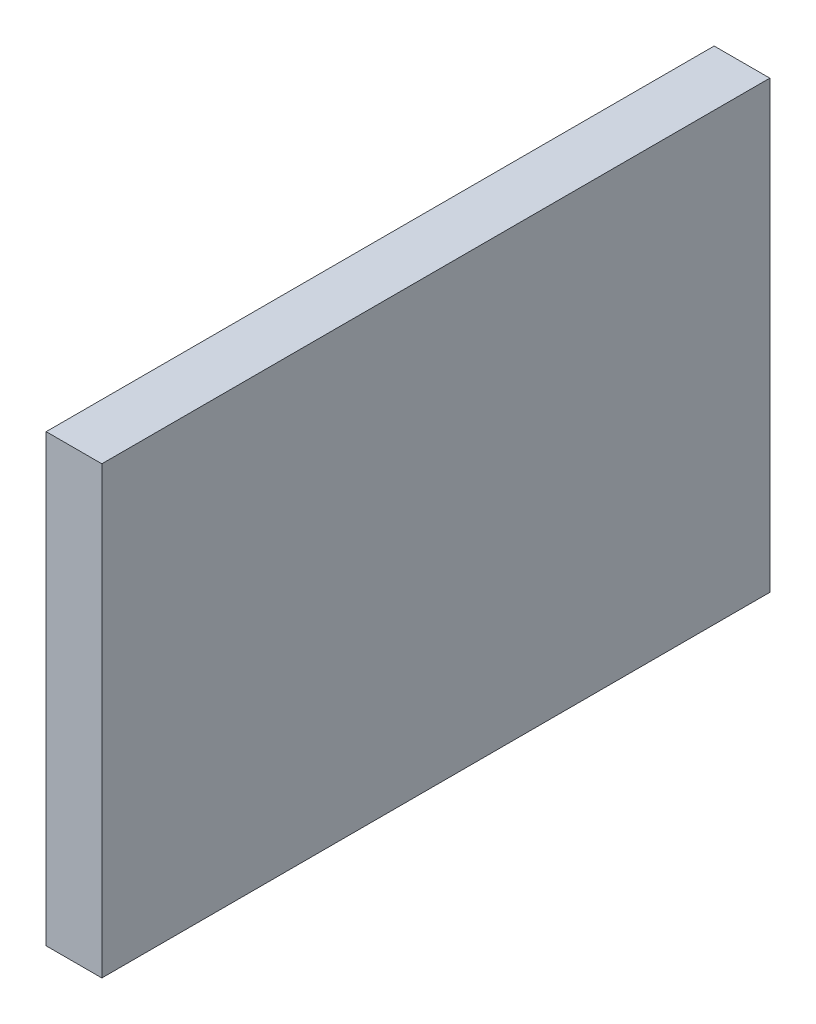
ISO-10303-21;
HEADER;
FILE_DESCRIPTION(('STEP AP214'),'2;1');
FILE_NAME('part.step','',(''),(''),'','','');
FILE_SCHEMA(('AUTOMOTIVE_DESIGN { 1 0 10303 214 1 1 1 1 }'));
ENDSEC;
DATA;
#1=APPLICATION_CONTEXT('core data for automotive mechanical design processes');
#2=APPLICATION_PROTOCOL_DEFINITION('international standard','automotive_design',2000,#1);
#3=PRODUCT_CONTEXT('',#1,'mechanical');
#4=PRODUCT('Part','Part','',(#3));
#5=PRODUCT_RELATED_PRODUCT_CATEGORY('part','',(#4));
#6=PRODUCT_DEFINITION_FORMATION('','',#4);
#7=PRODUCT_DEFINITION_CONTEXT('part definition',#1,'design');
#8=PRODUCT_DEFINITION('design','',#6,#7);
#9=PRODUCT_DEFINITION_SHAPE('','',#8);
#10=(LENGTH_UNIT() NAMED_UNIT(*) SI_UNIT(.MILLI.,.METRE.));
#11=(NAMED_UNIT(*) PLANE_ANGLE_UNIT() SI_UNIT($,.RADIAN.));
#12=(NAMED_UNIT(*) SI_UNIT($,.STERADIAN.) SOLID_ANGLE_UNIT());
#13=UNCERTAINTY_MEASURE_WITH_UNIT(LENGTH_MEASURE(1.E-05),#10,'distance_accuracy_value','');
#14=(GEOMETRIC_REPRESENTATION_CONTEXT(3) GLOBAL_UNCERTAINTY_ASSIGNED_CONTEXT((#13)) GLOBAL_UNIT_ASSIGNED_CONTEXT((#10,
#11,#12)) REPRESENTATION_CONTEXT('',''));
#15=CARTESIAN_POINT('',(0.,0.,0.));
#16=DIRECTION('',(0.,0.,1.));
#17=DIRECTION('',(1.,0.,0.));
#18=AXIS2_PLACEMENT_3D('',#15,#16,#17);
#19=CARTESIAN_POINT('',(0.635,-5.08,0.));
#20=DIRECTION('',(-1.,0.,0.));
#21=DIRECTION('',(0.,0.,1.));
#22=AXIS2_PLACEMENT_3D('',#19,#20,#21);
#23=PLANE('',#22);
#24=DIRECTION('',(0.,0.,-1.));
#25=VECTOR('',#24,1.);
#26=CARTESIAN_POINT('',(0.635,5.08,0.));
#27=LINE('',#26,#25);
#28=CARTESIAN_POINT('',(0.635,5.08,0.));
#29=VERTEX_POINT('',#28);
#30=CARTESIAN_POINT('',(0.635,5.08,15.24));
#31=VERTEX_POINT('',#30);
#32=EDGE_CURVE('E20',#29,#31,#27,.F.);
#33=ORIENTED_EDGE('',*,*,#32,.T.);
#34=DIRECTION('',(0.,1.,0.));
#35=VECTOR('',#34,1.);
#36=CARTESIAN_POINT('',(0.635,5.08,15.24));
#37=LINE('',#36,#35);
#38=CARTESIAN_POINT('',(0.635,-5.08,15.24));
#39=VERTEX_POINT('',#38);
#40=EDGE_CURVE('E55',#31,#39,#37,.F.);
#41=ORIENTED_EDGE('',*,*,#40,.T.);
#42=DIRECTION('',(0.,0.,1.));
#43=VECTOR('',#42,1.);
#44=CARTESIAN_POINT('',(0.635,-5.08,0.));
#45=LINE('',#44,#43);
#46=CARTESIAN_POINT('',(0.635,-5.08,0.));
#47=VERTEX_POINT('',#46);
#48=EDGE_CURVE('E76',#39,#47,#45,.F.);
#49=ORIENTED_EDGE('',*,*,#48,.T.);
#50=DIRECTION('',(0.,1.,0.));
#51=VECTOR('',#50,1.);
#52=CARTESIAN_POINT('',(0.635,5.08,0.));
#53=LINE('',#52,#51);
#54=EDGE_CURVE('E58',#29,#47,#53,.F.);
#55=ORIENTED_EDGE('',*,*,#54,.F.);
#56=EDGE_LOOP('',(#33,#41,#49,#55));
#57=FACE_BOUND('',#56,.T.);
#58=ADVANCED_FACE('F17',(#57),#23,.F.);
#59=CARTESIAN_POINT('',(0.635,5.08,0.));
#60=DIRECTION('',(0.,-1.,0.));
#61=DIRECTION('',(0.,0.,-1.));
#62=AXIS2_PLACEMENT_3D('',#59,#60,#61);
#63=PLANE('',#62);
#64=DIRECTION('',(0.,0.,-1.));
#65=VECTOR('',#64,1.);
#66=CARTESIAN_POINT('',(-0.635,5.08,0.));
#67=LINE('',#66,#65);
#68=CARTESIAN_POINT('',(-0.635,5.08,0.));
#69=VERTEX_POINT('',#68);
#70=CARTESIAN_POINT('',(-0.635,5.08,15.24));
#71=VERTEX_POINT('',#70);
#72=EDGE_CURVE('E73',#69,#71,#67,.F.);
#73=ORIENTED_EDGE('',*,*,#72,.T.);
#74=DIRECTION('',(-1.,0.,0.));
#75=VECTOR('',#74,1.);
#76=CARTESIAN_POINT('',(-0.635,5.08,15.24));
#77=LINE('',#76,#75);
#78=EDGE_CURVE('E63',#71,#31,#77,.F.);
#79=ORIENTED_EDGE('',*,*,#78,.T.);
#80=ORIENTED_EDGE('',*,*,#32,.F.);
#81=DIRECTION('',(-1.,0.,0.));
#82=VECTOR('',#81,1.);
#83=CARTESIAN_POINT('',(-0.635,5.08,0.));
#84=LINE('',#83,#82);
#85=EDGE_CURVE('E78',#69,#29,#84,.F.);
#86=ORIENTED_EDGE('',*,*,#85,.F.);
#87=EDGE_LOOP('',(#73,#79,#80,#86));
#88=FACE_BOUND('',#87,.T.);
#89=ADVANCED_FACE('F72',(#88),#63,.F.);
#90=CARTESIAN_POINT('',(-0.635,5.08,15.24));
#91=DIRECTION('',(0.,0.,-1.));
#92=DIRECTION('',(-1.,0.,0.));
#93=AXIS2_PLACEMENT_3D('',#90,#91,#92);
#94=PLANE('',#93);
#95=DIRECTION('',(1.,0.,0.));
#96=VECTOR('',#95,1.);
#97=CARTESIAN_POINT('',(-0.635,-5.08,15.24));
#98=LINE('',#97,#96);
#99=CARTESIAN_POINT('',(-0.635,-5.08,15.24));
#100=VERTEX_POINT('',#99);
#101=EDGE_CURVE('E69',#100,#39,#98,.T.);
#102=ORIENTED_EDGE('',*,*,#101,.T.);
#103=ORIENTED_EDGE('',*,*,#40,.F.);
#104=ORIENTED_EDGE('',*,*,#78,.F.);
#105=DIRECTION('',(0.,1.,0.));
#106=VECTOR('',#105,1.);
#107=CARTESIAN_POINT('',(-0.635,5.08,15.24));
#108=LINE('',#107,#106);
#109=EDGE_CURVE('E83',#71,#100,#108,.F.);
#110=ORIENTED_EDGE('',*,*,#109,.T.);
#111=EDGE_LOOP('',(#102,#103,#104,#110));
#112=FACE_BOUND('',#111,.T.);
#113=ADVANCED_FACE('F66',(#112),#94,.F.);
#114=CARTESIAN_POINT('',(-0.635,-5.08,0.));
#115=DIRECTION('',(0.,1.,0.));
#116=DIRECTION('',(0.,0.,1.));
#117=AXIS2_PLACEMENT_3D('',#114,#115,#116);
#118=PLANE('',#117);
#119=ORIENTED_EDGE('',*,*,#48,.F.);
#120=ORIENTED_EDGE('',*,*,#101,.F.);
#121=DIRECTION('',(0.,0.,-1.));
#122=VECTOR('',#121,1.);
#123=CARTESIAN_POINT('',(-0.635,-5.08,0.));
#124=LINE('',#123,#122);
#125=CARTESIAN_POINT('',(-0.635,-5.08,0.));
#126=VERTEX_POINT('',#125);
#127=EDGE_CURVE('E26',#100,#126,#124,.T.);
#128=ORIENTED_EDGE('',*,*,#127,.T.);
#129=DIRECTION('',(-1.,0.,0.));
#130=VECTOR('',#129,1.);
#131=CARTESIAN_POINT('',(-0.635,-5.08,0.));
#132=LINE('',#131,#130);
#133=EDGE_CURVE('E34',#47,#126,#132,.T.);
#134=ORIENTED_EDGE('',*,*,#133,.F.);
#135=EDGE_LOOP('',(#119,#120,#128,#134));
#136=FACE_BOUND('',#135,.T.);
#137=ADVANCED_FACE('F88',(#136),#118,.F.);
#138=CARTESIAN_POINT('',(-0.635,5.08,0.));
#139=DIRECTION('',(0.,0.,-1.));
#140=DIRECTION('',(-1.,0.,0.));
#141=AXIS2_PLACEMENT_3D('',#138,#139,#140);
#142=PLANE('',#141);
#143=ORIENTED_EDGE('',*,*,#133,.T.);
#144=DIRECTION('',(0.,1.,0.));
#145=VECTOR('',#144,1.);
#146=CARTESIAN_POINT('',(-0.635,5.08,0.));
#147=LINE('',#146,#145);
#148=EDGE_CURVE('E11',#126,#69,#147,.T.);
#149=ORIENTED_EDGE('',*,*,#148,.T.);
#150=ORIENTED_EDGE('',*,*,#85,.T.);
#151=ORIENTED_EDGE('',*,*,#54,.T.);
#152=EDGE_LOOP('',(#143,#149,#150,#151));
#153=FACE_BOUND('',#152,.T.);
#154=ADVANCED_FACE('F91',(#153),#142,.T.);
#155=CARTESIAN_POINT('',(-0.635,5.08,0.));
#156=DIRECTION('',(1.,0.,0.));
#157=DIRECTION('',(0.,0.,-1.));
#158=AXIS2_PLACEMENT_3D('',#155,#156,#157);
#159=PLANE('',#158);
#160=ORIENTED_EDGE('',*,*,#127,.F.);
#161=ORIENTED_EDGE('',*,*,#109,.F.);
#162=ORIENTED_EDGE('',*,*,#72,.F.);
#163=ORIENTED_EDGE('',*,*,#148,.F.);
#164=EDGE_LOOP('',(#160,#161,#162,#163));
#165=FACE_BOUND('',#164,.T.);
#166=ADVANCED_FACE('F90',(#165),#159,.F.);
#167=CLOSED_SHELL('',(#58,#89,#113,#137,#154,#166));
#168=MANIFOLD_SOLID_BREP('B1',#167);
#169=ADVANCED_BREP_SHAPE_REPRESENTATION('',(#18,#168),#14);
#170=SHAPE_DEFINITION_REPRESENTATION(#9,#169);
ENDSEC;
END-ISO-10303-21;
